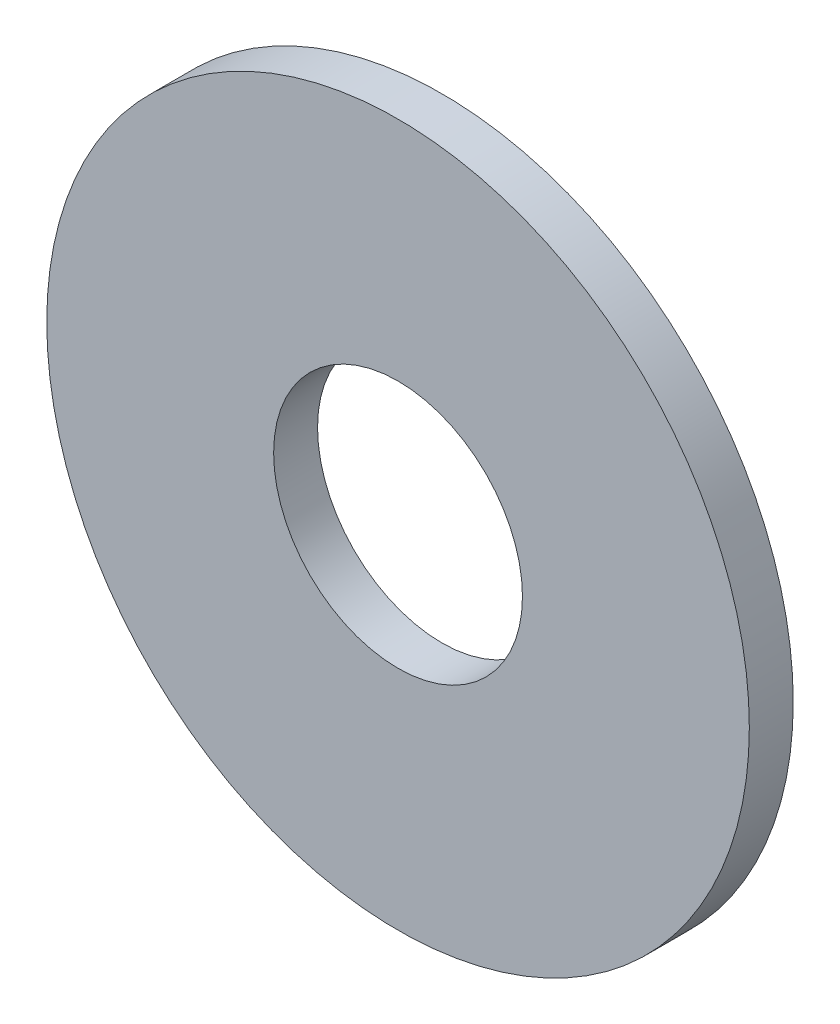
ISO-10303-21;
HEADER;
FILE_DESCRIPTION(('STEP AP214'),'2;1');
FILE_NAME('part.step','',(''),(''),'','','');
FILE_SCHEMA(('AUTOMOTIVE_DESIGN { 1 0 10303 214 1 1 1 1 }'));
ENDSEC;
DATA;
#1=APPLICATION_CONTEXT('core data for automotive mechanical design processes');
#2=APPLICATION_PROTOCOL_DEFINITION('international standard','automotive_design',2000,#1);
#3=PRODUCT_CONTEXT('',#1,'mechanical');
#4=PRODUCT('Part','Part','',(#3));
#5=PRODUCT_RELATED_PRODUCT_CATEGORY('part','',(#4));
#6=PRODUCT_DEFINITION_FORMATION('','',#4);
#7=PRODUCT_DEFINITION_CONTEXT('part definition',#1,'design');
#8=PRODUCT_DEFINITION('design','',#6,#7);
#9=PRODUCT_DEFINITION_SHAPE('','',#8);
#10=(LENGTH_UNIT() NAMED_UNIT(*) SI_UNIT(.MILLI.,.METRE.));
#11=(NAMED_UNIT(*) PLANE_ANGLE_UNIT() SI_UNIT($,.RADIAN.));
#12=(NAMED_UNIT(*) SI_UNIT($,.STERADIAN.) SOLID_ANGLE_UNIT());
#13=UNCERTAINTY_MEASURE_WITH_UNIT(LENGTH_MEASURE(1.E-05),#10,'distance_accuracy_value','');
#14=(GEOMETRIC_REPRESENTATION_CONTEXT(3) GLOBAL_UNCERTAINTY_ASSIGNED_CONTEXT((#13)) GLOBAL_UNIT_ASSIGNED_CONTEXT((#10,
#11,#12)) REPRESENTATION_CONTEXT('',''));
#15=CARTESIAN_POINT('',(0.,0.,0.));
#16=DIRECTION('',(0.,0.,1.));
#17=DIRECTION('',(1.,0.,0.));
#18=AXIS2_PLACEMENT_3D('',#15,#16,#17);
#19=CARTESIAN_POINT('',(0.,0.,3.));
#20=DIRECTION('',(0.,0.,1.));
#21=DIRECTION('',(1.,0.,0.));
#22=AXIS2_PLACEMENT_3D('',#19,#20,#21);
#23=PLANE('',#22);
#24=CARTESIAN_POINT('',(0.,0.,3.));
#25=DIRECTION('',(0.,0.,1.));
#26=DIRECTION('',(1.,0.,0.));
#27=AXIS2_PLACEMENT_3D('',#24,#25,#26);
#28=CIRCLE('',#27,24.);
#29=CARTESIAN_POINT('',(24.,0.,3.));
#30=VERTEX_POINT('',#29);
#31=EDGE_CURVE('E10',#30,#30,#28,.T.);
#32=ORIENTED_EDGE('',*,*,#31,.T.);
#33=EDGE_LOOP('',(#32));
#34=FACE_BOUND('',#33,.T.);
#35=CARTESIAN_POINT('',(0.,0.,3.));
#36=DIRECTION('',(0.,0.,1.));
#37=DIRECTION('',(1.,0.,0.));
#38=AXIS2_PLACEMENT_3D('',#35,#36,#37);
#39=CIRCLE('',#38,8.5);
#40=CARTESIAN_POINT('',(8.5,0.,3.));
#41=VERTEX_POINT('',#40);
#42=EDGE_CURVE('E47',#41,#41,#39,.T.);
#43=ORIENTED_EDGE('',*,*,#42,.F.);
#44=EDGE_LOOP('',(#43));
#45=FACE_BOUND('',#44,.T.);
#46=ADVANCED_FACE('F32',(#34,#45),#23,.T.);
#47=CARTESIAN_POINT('',(0.,0.,0.));
#48=DIRECTION('',(0.,0.,1.));
#49=DIRECTION('',(1.,0.,0.));
#50=AXIS2_PLACEMENT_3D('',#47,#48,#49);
#51=PLANE('',#50);
#52=CARTESIAN_POINT('',(0.,0.,0.));
#53=DIRECTION('',(0.,0.,1.));
#54=DIRECTION('',(1.,0.,0.));
#55=AXIS2_PLACEMENT_3D('',#52,#53,#54);
#56=CIRCLE('',#55,24.);
#57=CARTESIAN_POINT('',(24.,0.,0.));
#58=VERTEX_POINT('',#57);
#59=EDGE_CURVE('E36',#58,#58,#56,.T.);
#60=ORIENTED_EDGE('',*,*,#59,.F.);
#61=EDGE_LOOP('',(#60));
#62=FACE_BOUND('',#61,.T.);
#63=CARTESIAN_POINT('',(0.,0.,0.));
#64=DIRECTION('',(0.,0.,1.));
#65=DIRECTION('',(1.,0.,0.));
#66=AXIS2_PLACEMENT_3D('',#63,#64,#65);
#67=CIRCLE('',#66,8.5);
#68=CARTESIAN_POINT('',(8.5,0.,0.));
#69=VERTEX_POINT('',#68);
#70=EDGE_CURVE('E49',#69,#69,#67,.T.);
#71=ORIENTED_EDGE('',*,*,#70,.T.);
#72=EDGE_LOOP('',(#71));
#73=FACE_BOUND('',#72,.T.);
#74=ADVANCED_FACE('F62',(#62,#73),#51,.F.);
#75=CARTESIAN_POINT('',(0.,0.,3.));
#76=DIRECTION('',(0.,0.,-1.));
#77=DIRECTION('',(-1.,0.,0.));
#78=AXIS2_PLACEMENT_3D('',#75,#76,#77);
#79=CYLINDRICAL_SURFACE('',#78,24.);
#80=ORIENTED_EDGE('',*,*,#31,.F.);
#81=EDGE_LOOP('',(#80));
#82=FACE_BOUND('',#81,.T.);
#83=ORIENTED_EDGE('',*,*,#59,.T.);
#84=EDGE_LOOP('',(#83));
#85=FACE_BOUND('',#84,.T.);
#86=ADVANCED_FACE('F34',(#82,#85),#79,.T.);
#87=CARTESIAN_POINT('',(0.,0.,3.));
#88=DIRECTION('',(0.,0.,-1.));
#89=DIRECTION('',(-1.,0.,0.));
#90=AXIS2_PLACEMENT_3D('',#87,#88,#89);
#91=CYLINDRICAL_SURFACE('',#90,8.5);
#92=ORIENTED_EDGE('',*,*,#42,.T.);
#93=EDGE_LOOP('',(#92));
#94=FACE_BOUND('',#93,.T.);
#95=ORIENTED_EDGE('',*,*,#70,.F.);
#96=EDGE_LOOP('',(#95));
#97=FACE_BOUND('',#96,.T.);
#98=ADVANCED_FACE('F58',(#94,#97),#91,.F.);
#99=CLOSED_SHELL('',(#46,#74,#86,#98));
#100=MANIFOLD_SOLID_BREP('B2',#99);
#101=ADVANCED_BREP_SHAPE_REPRESENTATION('',(#18,#100),#14);
#102=SHAPE_DEFINITION_REPRESENTATION(#9,#101);
ENDSEC;
END-ISO-10303-21;
